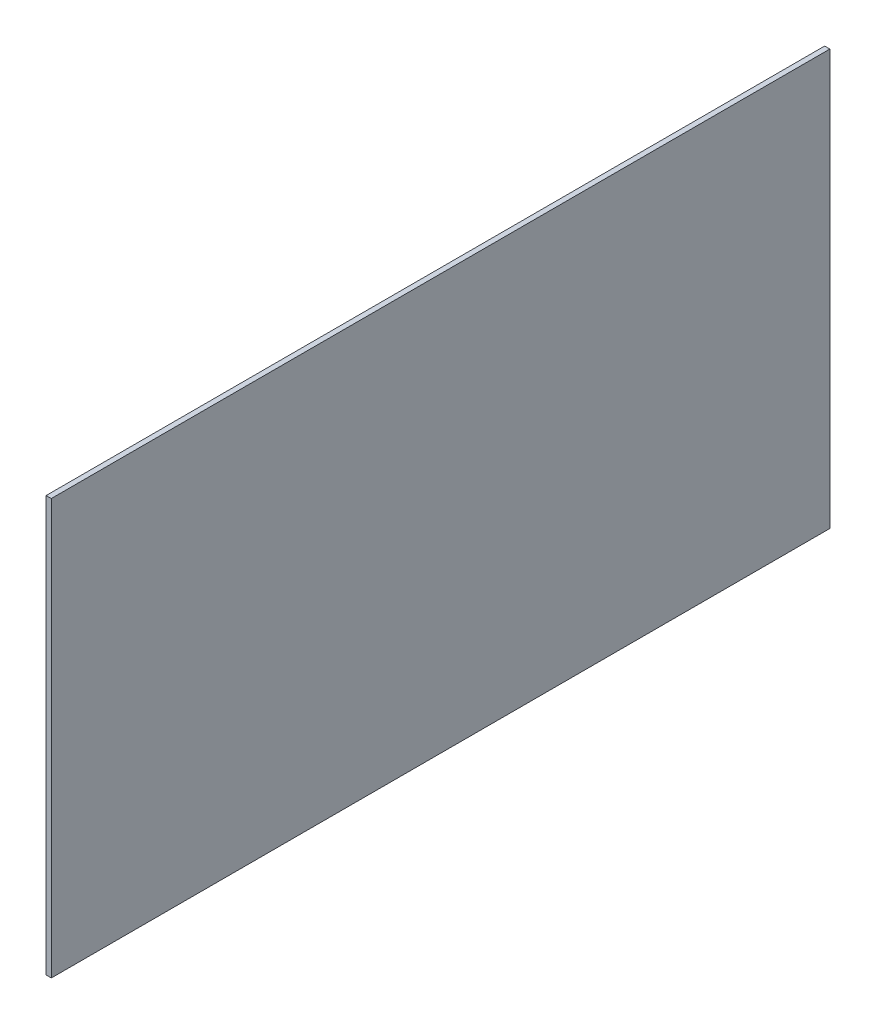
ISO-10303-21;
HEADER;
FILE_DESCRIPTION(('STEP AP214'),'2;1');
FILE_NAME('part.step','',(''),(''),'','','');
FILE_SCHEMA(('AUTOMOTIVE_DESIGN { 1 0 10303 214 1 1 1 1 }'));
ENDSEC;
DATA;
#1=APPLICATION_CONTEXT('core data for automotive mechanical design processes');
#2=APPLICATION_PROTOCOL_DEFINITION('international standard','automotive_design',2000,#1);
#3=PRODUCT_CONTEXT('',#1,'mechanical');
#4=PRODUCT('Part','Part','',(#3));
#5=PRODUCT_RELATED_PRODUCT_CATEGORY('part','',(#4));
#6=PRODUCT_DEFINITION_FORMATION('','',#4);
#7=PRODUCT_DEFINITION_CONTEXT('part definition',#1,'design');
#8=PRODUCT_DEFINITION('design','',#6,#7);
#9=PRODUCT_DEFINITION_SHAPE('','',#8);
#10=(LENGTH_UNIT() NAMED_UNIT(*) SI_UNIT(.MILLI.,.METRE.));
#11=(NAMED_UNIT(*) PLANE_ANGLE_UNIT() SI_UNIT($,.RADIAN.));
#12=(NAMED_UNIT(*) SI_UNIT($,.STERADIAN.) SOLID_ANGLE_UNIT());
#13=UNCERTAINTY_MEASURE_WITH_UNIT(LENGTH_MEASURE(1.E-05),#10,'distance_accuracy_value','');
#14=(GEOMETRIC_REPRESENTATION_CONTEXT(3) GLOBAL_UNCERTAINTY_ASSIGNED_CONTEXT((#13)) GLOBAL_UNIT_ASSIGNED_CONTEXT((#10,
#11,#12)) REPRESENTATION_CONTEXT('',''));
#15=CARTESIAN_POINT('',(0.,0.,0.));
#16=DIRECTION('',(0.,0.,1.));
#17=DIRECTION('',(1.,0.,0.));
#18=AXIS2_PLACEMENT_3D('',#15,#16,#17);
#19=CARTESIAN_POINT('',(1.5,-120.,-225.));
#20=DIRECTION('',(0.,0.,1.));
#21=DIRECTION('',(1.,0.,0.));
#22=AXIS2_PLACEMENT_3D('',#19,#20,#21);
#23=PLANE('',#22);
#24=DIRECTION('',(0.,1.,0.));
#25=VECTOR('',#24,1.);
#26=CARTESIAN_POINT('',(-1.5,-120.,-225.));
#27=LINE('',#26,#25);
#28=CARTESIAN_POINT('',(-1.5,-120.,-225.));
#29=VERTEX_POINT('',#28);
#30=CARTESIAN_POINT('',(-1.5,120.,-225.));
#31=VERTEX_POINT('',#30);
#32=EDGE_CURVE('E95',#29,#31,#27,.T.);
#33=ORIENTED_EDGE('',*,*,#32,.T.);
#34=DIRECTION('',(-1.,0.,0.));
#35=VECTOR('',#34,1.);
#36=CARTESIAN_POINT('',(1.5,120.,-225.));
#37=LINE('',#36,#35);
#38=CARTESIAN_POINT('',(1.5,120.,-225.));
#39=VERTEX_POINT('',#38);
#40=EDGE_CURVE('E11',#39,#31,#37,.T.);
#41=ORIENTED_EDGE('',*,*,#40,.F.);
#42=DIRECTION('',(0.,1.,0.));
#43=VECTOR('',#42,1.);
#44=CARTESIAN_POINT('',(1.5,-120.,-225.));
#45=LINE('',#44,#43);
#46=CARTESIAN_POINT('',(1.5,-120.,-225.));
#47=VERTEX_POINT('',#46);
#48=EDGE_CURVE('E83',#47,#39,#45,.T.);
#49=ORIENTED_EDGE('',*,*,#48,.F.);
#50=DIRECTION('',(-1.,0.,0.));
#51=VECTOR('',#50,1.);
#52=CARTESIAN_POINT('',(1.5,-120.,-225.));
#53=LINE('',#52,#51);
#54=EDGE_CURVE('E91',#47,#29,#53,.T.);
#55=ORIENTED_EDGE('',*,*,#54,.T.);
#56=EDGE_LOOP('',(#33,#41,#49,#55));
#57=FACE_BOUND('',#56,.T.);
#58=ADVANCED_FACE('F32',(#57),#23,.F.);
#59=CARTESIAN_POINT('',(1.5,120.,225.));
#60=DIRECTION('',(0.,-1.,0.));
#61=DIRECTION('',(0.,0.,-1.));
#62=AXIS2_PLACEMENT_3D('',#59,#60,#61);
#63=PLANE('',#62);
#64=DIRECTION('',(0.,0.,1.));
#65=VECTOR('',#64,1.);
#66=CARTESIAN_POINT('',(-1.5,120.,225.));
#67=LINE('',#66,#65);
#68=CARTESIAN_POINT('',(-1.5,120.,225.));
#69=VERTEX_POINT('',#68);
#70=EDGE_CURVE('E87',#31,#69,#67,.T.);
#71=ORIENTED_EDGE('',*,*,#70,.T.);
#72=DIRECTION('',(-1.,0.,0.));
#73=VECTOR('',#72,1.);
#74=CARTESIAN_POINT('',(1.5,120.,225.));
#75=LINE('',#74,#73);
#76=CARTESIAN_POINT('',(1.5,120.,225.));
#77=VERTEX_POINT('',#76);
#78=EDGE_CURVE('E40',#77,#69,#75,.T.);
#79=ORIENTED_EDGE('',*,*,#78,.F.);
#80=DIRECTION('',(0.,0.,1.));
#81=VECTOR('',#80,1.);
#82=CARTESIAN_POINT('',(1.5,120.,225.));
#83=LINE('',#82,#81);
#84=EDGE_CURVE('E78',#39,#77,#83,.T.);
#85=ORIENTED_EDGE('',*,*,#84,.F.);
#86=ORIENTED_EDGE('',*,*,#40,.T.);
#87=EDGE_LOOP('',(#71,#79,#85,#86));
#88=FACE_BOUND('',#87,.T.);
#89=ADVANCED_FACE('F86',(#88),#63,.F.);
#90=CARTESIAN_POINT('',(1.5,-120.,225.));
#91=DIRECTION('',(0.,0.,-1.));
#92=DIRECTION('',(-1.,0.,0.));
#93=AXIS2_PLACEMENT_3D('',#90,#91,#92);
#94=PLANE('',#93);
#95=DIRECTION('',(0.,-1.,0.));
#96=VECTOR('',#95,1.);
#97=CARTESIAN_POINT('',(-1.5,-120.,225.));
#98=LINE('',#97,#96);
#99=CARTESIAN_POINT('',(-1.5,-120.,225.));
#100=VERTEX_POINT('',#99);
#101=EDGE_CURVE('E65',#69,#100,#98,.T.);
#102=ORIENTED_EDGE('',*,*,#101,.T.);
#103=DIRECTION('',(-1.,0.,0.));
#104=VECTOR('',#103,1.);
#105=CARTESIAN_POINT('',(1.5,-120.,225.));
#106=LINE('',#105,#104);
#107=CARTESIAN_POINT('',(1.5,-120.,225.));
#108=VERTEX_POINT('',#107);
#109=EDGE_CURVE('E88',#108,#100,#106,.T.);
#110=ORIENTED_EDGE('',*,*,#109,.F.);
#111=DIRECTION('',(0.,-1.,0.));
#112=VECTOR('',#111,1.);
#113=CARTESIAN_POINT('',(1.5,-120.,225.));
#114=LINE('',#113,#112);
#115=EDGE_CURVE('E81',#77,#108,#114,.T.);
#116=ORIENTED_EDGE('',*,*,#115,.F.);
#117=ORIENTED_EDGE('',*,*,#78,.T.);
#118=EDGE_LOOP('',(#102,#110,#116,#117));
#119=FACE_BOUND('',#118,.T.);
#120=ADVANCED_FACE('F89',(#119),#94,.F.);
#121=CARTESIAN_POINT('',(1.5,-120.,225.));
#122=DIRECTION('',(0.,1.,0.));
#123=DIRECTION('',(0.,0.,1.));
#124=AXIS2_PLACEMENT_3D('',#121,#122,#123);
#125=PLANE('',#124);
#126=DIRECTION('',(0.,0.,-1.));
#127=VECTOR('',#126,1.);
#128=CARTESIAN_POINT('',(-1.5,-120.,225.));
#129=LINE('',#128,#127);
#130=EDGE_CURVE('E71',#100,#29,#129,.T.);
#131=ORIENTED_EDGE('',*,*,#130,.T.);
#132=ORIENTED_EDGE('',*,*,#54,.F.);
#133=DIRECTION('',(0.,0.,-1.));
#134=VECTOR('',#133,1.);
#135=CARTESIAN_POINT('',(1.5,-120.,225.));
#136=LINE('',#135,#134);
#137=EDGE_CURVE('E48',#108,#47,#136,.T.);
#138=ORIENTED_EDGE('',*,*,#137,.F.);
#139=ORIENTED_EDGE('',*,*,#109,.T.);
#140=EDGE_LOOP('',(#131,#132,#138,#139));
#141=FACE_BOUND('',#140,.T.);
#142=ADVANCED_FACE('F102',(#141),#125,.F.);
#143=CARTESIAN_POINT('',(1.5,0.,0.));
#144=DIRECTION('',(-1.,0.,0.));
#145=DIRECTION('',(0.,0.,1.));
#146=AXIS2_PLACEMENT_3D('',#143,#144,#145);
#147=PLANE('',#146);
#148=ORIENTED_EDGE('',*,*,#48,.T.);
#149=ORIENTED_EDGE('',*,*,#84,.T.);
#150=ORIENTED_EDGE('',*,*,#115,.T.);
#151=ORIENTED_EDGE('',*,*,#137,.T.);
#152=EDGE_LOOP('',(#148,#149,#150,#151));
#153=FACE_BOUND('',#152,.T.);
#154=ADVANCED_FACE('F79',(#153),#147,.F.);
#155=CARTESIAN_POINT('',(-1.5,0.,0.));
#156=DIRECTION('',(-1.,0.,0.));
#157=DIRECTION('',(0.,0.,1.));
#158=AXIS2_PLACEMENT_3D('',#155,#156,#157);
#159=PLANE('',#158);
#160=ORIENTED_EDGE('',*,*,#32,.F.);
#161=ORIENTED_EDGE('',*,*,#130,.F.);
#162=ORIENTED_EDGE('',*,*,#101,.F.);
#163=ORIENTED_EDGE('',*,*,#70,.F.);
#164=EDGE_LOOP('',(#160,#161,#162,#163));
#165=FACE_BOUND('',#164,.T.);
#166=ADVANCED_FACE('F105',(#165),#159,.T.);
#167=CLOSED_SHELL('',(#58,#89,#120,#142,#154,#166));
#168=MANIFOLD_SOLID_BREP('B2',#167);
#169=ADVANCED_BREP_SHAPE_REPRESENTATION('',(#18,#168),#14);
#170=SHAPE_DEFINITION_REPRESENTATION(#9,#169);
ENDSEC;
END-ISO-10303-21;
